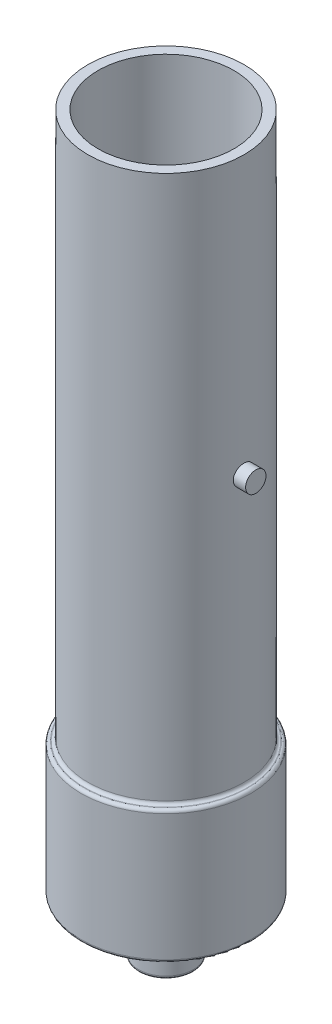
ISO-10303-21;
HEADER;
FILE_DESCRIPTION(('STEP AP214'),'2;1');
FILE_NAME('part.step','',(''),(''),'','','');
FILE_SCHEMA(('AUTOMOTIVE_DESIGN { 1 0 10303 214 1 1 1 1 }'));
ENDSEC;
DATA;
#1=APPLICATION_CONTEXT('core data for automotive mechanical design processes');
#2=APPLICATION_PROTOCOL_DEFINITION('international standard','automotive_design',2000,#1);
#3=PRODUCT_CONTEXT('',#1,'mechanical');
#4=PRODUCT('Part','Part','',(#3));
#5=PRODUCT_RELATED_PRODUCT_CATEGORY('part','',(#4));
#6=PRODUCT_DEFINITION_FORMATION('','',#4);
#7=PRODUCT_DEFINITION_CONTEXT('part definition',#1,'design');
#8=PRODUCT_DEFINITION('design','',#6,#7);
#9=PRODUCT_DEFINITION_SHAPE('','',#8);
#10=(LENGTH_UNIT() NAMED_UNIT(*) SI_UNIT(.MILLI.,.METRE.));
#11=(NAMED_UNIT(*) PLANE_ANGLE_UNIT() SI_UNIT($,.RADIAN.));
#12=(NAMED_UNIT(*) SI_UNIT($,.STERADIAN.) SOLID_ANGLE_UNIT());
#13=UNCERTAINTY_MEASURE_WITH_UNIT(LENGTH_MEASURE(1.E-05),#10,'distance_accuracy_value','');
#14=(GEOMETRIC_REPRESENTATION_CONTEXT(3) GLOBAL_UNCERTAINTY_ASSIGNED_CONTEXT((#13)) GLOBAL_UNIT_ASSIGNED_CONTEXT((#10,
#11,#12)) REPRESENTATION_CONTEXT('',''));
#15=CARTESIAN_POINT('',(0.,0.,0.));
#16=DIRECTION('',(0.,0.,1.));
#17=DIRECTION('',(1.,0.,0.));
#18=AXIS2_PLACEMENT_3D('',#15,#16,#17);
#19=CARTESIAN_POINT('',(0.,87.,0.));
#20=DIRECTION('',(0.,-1.,0.));
#21=DIRECTION('',(0.,0.,-1.));
#22=AXIS2_PLACEMENT_3D('',#19,#20,#21);
#23=CYLINDRICAL_SURFACE('',#22,10.);
#24=CARTESIAN_POINT('',(0.,17.4,0.));
#25=DIRECTION('',(0.,-1.,0.));
#26=DIRECTION('',(0.,0.,-1.));
#27=AXIS2_PLACEMENT_3D('',#24,#25,#26);
#28=CIRCLE('',#27,10.);
#29=CARTESIAN_POINT('',(0.,17.4,-10.));
#30=VERTEX_POINT('',#29);
#31=EDGE_CURVE('E11',#30,#30,#28,.F.);
#32=ORIENTED_EDGE('',*,*,#31,.T.);
#33=EDGE_LOOP('',(#32));
#34=FACE_BOUND('',#33,.T.);
#35=CARTESIAN_POINT('',(9.91448309293026,51.5,-1.305));
#36=CARTESIAN_POINT('',(9.91448418098017,51.4270332152483,-1.30499691434178));
#37=CARTESIAN_POINT('',(9.91529730579845,51.3540214886229,-1.29885962619016));
#38=CARTESIAN_POINT('',(9.91846051986674,51.2100318827835,-1.27447489418102));
#39=CARTESIAN_POINT('',(9.92081219326053,51.1390561786408,-1.25621496814225));
#40=CARTESIAN_POINT('',(9.92678170698423,51.0012440893889,-1.20813410938914));
#41=CARTESIAN_POINT('',(9.93039866484054,50.9344048574338,-1.17832123273123));
#42=CARTESIAN_POINT('',(9.93849014805313,50.8066898021017,-1.10799837386438));
#43=CARTESIAN_POINT('',(9.9429645326472,50.7458130023583,-1.0674901470799));
#44=CARTESIAN_POINT('',(9.95229721603554,50.6313683984253,-0.97666247621837));
#45=CARTESIAN_POINT('',(9.95715747077284,50.5778421534758,-0.926290861734877));
#46=CARTESIAN_POINT('',(9.9666967058992,50.4799773065176,-0.817278680913402));
#47=CARTESIAN_POINT('',(9.97137567707169,50.4356391711413,-0.758637694856652));
#48=CARTESIAN_POINT('',(9.98004527438682,50.3572590999145,-0.63448901325451));
#49=CARTESIAN_POINT('',(9.98403335365794,50.3232549254112,-0.568957284455809));
#50=CARTESIAN_POINT('',(9.99085028381682,50.2667499855573,-0.433052531309081));
#51=CARTESIAN_POINT('',(9.9936791814377,50.2442487564496,-0.362679702266539));
#52=CARTESIAN_POINT('',(9.99784522708334,50.2115130163197,-0.219516157918825));
#53=CARTESIAN_POINT('',(9.99919078993409,50.2012092850941,-0.146741519284059));
#54=CARTESIAN_POINT('',(10.0002673151912,50.1929464182237,-0.000484502484752745));
#55=CARTESIAN_POINT('',(9.99999834649792,50.1949867557944,0.0729978453446168));
#56=CARTESIAN_POINT('',(9.99788290494134,50.2112988089934,0.218113166905785));
#57=CARTESIAN_POINT('',(9.99604603417925,50.2254960751852,0.289754669018367));
#58=CARTESIAN_POINT('',(9.99101193756161,50.2656024988957,0.429629536420904));
#59=CARTESIAN_POINT('',(9.98781468389904,50.2915118958179,0.497862832013257));
#60=CARTESIAN_POINT('',(9.9804025195115,50.3543856714451,0.629213821301065));
#61=CARTESIAN_POINT('',(9.97618466643927,50.3913820884961,0.692316006419299));
#62=CARTESIAN_POINT('',(9.96720282726618,50.4753563894287,0.811444372926343));
#63=CARTESIAN_POINT('',(9.96243881388256,50.5223347720472,0.867470200530354));
#64=CARTESIAN_POINT('',(9.9528555465964,50.6253559892305,0.971293181192356));
#65=CARTESIAN_POINT('',(9.94803614554095,50.6814637328856,1.01902593585157));
#66=CARTESIAN_POINT('',(9.93892021577619,50.8009285073688,1.10440682445899));
#67=CARTESIAN_POINT('',(9.93462368898326,50.8642855647646,1.14205492144678));
#68=CARTESIAN_POINT('',(9.92704006469537,50.9965098620051,1.20620250508217));
#69=CARTESIAN_POINT('',(9.92375346147722,51.0653797792359,1.23269653504608));
#70=CARTESIAN_POINT('',(9.9185712477685,51.2066436704192,1.27372524554413));
#71=CARTESIAN_POINT('',(9.91667556398397,51.2790374584684,1.28826055624324));
#72=CARTESIAN_POINT('',(9.91450333914017,51.4247244766258,1.30487331970326));
#73=CARTESIAN_POINT('',(9.9142150019736,51.4980071876342,1.30704153569554));
#74=CARTESIAN_POINT('',(9.91525889569122,51.6438908275908,1.29909832112043));
#75=CARTESIAN_POINT('',(9.91659108884213,51.7164917723739,1.2889871764722));
#76=CARTESIAN_POINT('',(9.92071516048487,51.8586771340753,1.25684879596861));
#77=CARTESIAN_POINT('',(9.92350162228045,51.9282717142288,1.23486576867507));
#78=CARTESIAN_POINT('',(9.93021586180371,52.0627872807168,1.17965324524407));
#79=CARTESIAN_POINT('',(9.93414368302461,52.1277080888324,1.14642332051874));
#80=CARTESIAN_POINT('',(9.9427262381349,52.2514431184916,1.06943816473376));
#81=CARTESIAN_POINT('',(9.94738501800241,52.3102201199808,1.02562356994277));
#82=CARTESIAN_POINT('',(9.95689197031909,52.4196187236904,0.928796439922654));
#83=CARTESIAN_POINT('',(9.96174015080557,52.4702399793502,0.875783514028994));
#84=CARTESIAN_POINT('',(9.97111600504537,52.5622104343446,0.761667406697446));
#85=CARTESIAN_POINT('',(9.97564149323699,52.6034998875592,0.700515868210137));
#86=CARTESIAN_POINT('',(9.98382912850754,52.6752206960807,0.572092674002406));
#87=CARTESIAN_POINT('',(9.98749129431257,52.7056522869099,0.50482115107275));
#88=CARTESIAN_POINT('',(9.99352998455802,52.7546955196757,0.36626364262335));
#89=CARTESIAN_POINT('',(9.99591021997531,52.7733413070756,0.294989911542307));
#90=CARTESIAN_POINT('',(9.9991323074537,52.798394618939,0.150290142921563));
#91=CARTESIAN_POINT('',(9.99997423544801,52.8048027474728,0.0768642117995393));
#92=CARTESIAN_POINT('',(10.0000244059738,52.8051868432657,-0.0694731056881064));
#93=CARTESIAN_POINT('',(9.99924473505945,52.7992547877692,-0.14238426351655));
#94=CARTESIAN_POINT('',(9.99616340299701,52.7753221885969,-0.286163741689926));
#95=CARTESIAN_POINT('',(9.9938617435951,52.7573216587671,-0.357032064378495));
#96=CARTESIAN_POINT('',(9.98799386414276,52.7097927552354,-0.494699389086431));
#97=CARTESIAN_POINT('',(9.98442817232576,52.6802691964357,-0.561500077308659));
#98=CARTESIAN_POINT('',(9.9764264003035,52.6105418536707,-0.689213612040499));
#99=CARTESIAN_POINT('',(9.9719903060027,52.5703378967406,-0.750126363175478));
#100=CARTESIAN_POINT('',(9.96270305607128,52.4800521790234,-0.864804225818869));
#101=CARTESIAN_POINT('',(9.95784916769583,52.4299020630972,-0.918515303678175));
#102=CARTESIAN_POINT('',(9.94829497455732,52.3212902760302,-1.01679485011713));
#103=CARTESIAN_POINT('',(9.94359470635514,52.2628266437725,-1.06136115541353));
#104=CARTESIAN_POINT('',(9.93485883260752,52.1389633332554,-1.1402484761737));
#105=CARTESIAN_POINT('',(9.93082610720865,52.0735355031878,-1.17452559005079));
#106=CARTESIAN_POINT('',(9.92391564462818,51.9378348657538,-1.23155628624968));
#107=CARTESIAN_POINT('',(9.92103666367204,51.8675673720242,-1.25432228490269));
#108=CARTESIAN_POINT('',(9.91745183183184,51.7474546091809,-1.28229165497502));
#109=CARTESIAN_POINT('',(9.91634417122562,51.6983640104077,-1.29079488130843));
#110=CARTESIAN_POINT('',(9.91485943381736,51.5995225741813,-1.30215008199544));
#111=CARTESIAN_POINT('',(9.91448235075504,51.5497717423895,-1.30500210477392));
#112=CARTESIAN_POINT('',(9.91448309293026,51.5,-1.305));
#113=B_SPLINE_CURVE_WITH_KNOTS('',3,(#35,#36,#37,#38,#39,#40,#41,#42,#43,#44,#45,#46,#47,#48,
#49,#50,#51,#52,#53,#54,#55,#56,#57,#58,#59,#60,#61,#62,#63,#64,#65,#66,#67,#68,#69,#70,#71,#72,
#73,#74,#75,#76,#77,#78,#79,#80,#81,#82,#83,#84,#85,#86,#87,#88,#89,#90,#91,#92,#93,#94,#95,#96,
#97,#98,#99,#100,#101,#102,#103,#104,#105,#106,#107,#108,#109,#110,#111,#112),.UNSPECIFIED.,.T.,
.F.,(4,2,2,2,2,2,2,2,2,2,2,2,2,2,2,2,2,2,2,2,2,2,2,2,2,2,2,2,2,2,2,2,2,2,2,2,2,2,4),(0.,
0.218718510918342,0.4376625772909,0.656454244413546,0.875210023627478,1.09515574483642,
1.31511263359239,1.53586386191316,1.75660618963945,1.97608971678302,2.19556387751207,
2.41370350580401,2.63184759321245,2.85062823548131,3.06941981143372,3.28984102734991,
3.5102630511023,3.73079278261204,3.95131089255834,4.1702084967962,4.38910100420354,
4.60718396342766,4.82527523412072,5.04461928008058,5.26397264413585,5.484692944059,
5.70540845595846,5.9254815509362,6.14554378247608,6.36397166431948,6.58239929556203,
6.80073575427851,7.01907574908423,7.23897180976055,7.45891982913166,7.67979339514733,
7.90042820747751,8.04962067499644,8.1988118640872),.UNSPECIFIED.);
#114=CARTESIAN_POINT('',(9.91448309293026,51.5,-1.305));
#115=VERTEX_POINT('',#114);
#116=EDGE_CURVE('E103',#115,#115,#113,.T.);
#117=ORIENTED_EDGE('',*,*,#116,.T.);
#118=EDGE_LOOP('',(#117));
#119=FACE_BOUND('',#118,.T.);
#120=CARTESIAN_POINT('',(0.,87.,0.));
#121=DIRECTION('',(0.,1.,0.));
#122=DIRECTION('',(0.,0.,1.));
#123=AXIS2_PLACEMENT_3D('',#120,#121,#122);
#124=CIRCLE('',#123,10.);
#125=CARTESIAN_POINT('',(0.,87.,10.));
#126=VERTEX_POINT('',#125);
#127=EDGE_CURVE('E91',#126,#126,#124,.T.);
#128=ORIENTED_EDGE('',*,*,#127,.F.);
#129=EDGE_LOOP('',(#128));
#130=FACE_BOUND('',#129,.T.);
#131=ADVANCED_FACE('F43',(#34,#119,#130),#23,.T.);
#132=CARTESIAN_POINT('',(0.,87.,0.));
#133=DIRECTION('',(0.,-1.,0.));
#134=DIRECTION('',(0.,0.,-1.));
#135=AXIS2_PLACEMENT_3D('',#132,#133,#134);
#136=CYLINDRICAL_SURFACE('',#135,8.7);
#137=CARTESIAN_POINT('',(0.,87.,0.));
#138=DIRECTION('',(0.,1.,0.));
#139=DIRECTION('',(0.,0.,1.));
#140=AXIS2_PLACEMENT_3D('',#137,#138,#139);
#141=CIRCLE('',#140,8.7);
#142=CARTESIAN_POINT('',(0.,87.,8.7));
#143=VERTEX_POINT('',#142);
#144=EDGE_CURVE('E95',#143,#143,#141,.T.);
#145=ORIENTED_EDGE('',*,*,#144,.T.);
#146=EDGE_LOOP('',(#145));
#147=FACE_BOUND('',#146,.T.);
#148=CARTESIAN_POINT('',(0.,3.,0.));
#149=DIRECTION('',(0.,1.,0.));
#150=DIRECTION('',(0.,0.,1.));
#151=AXIS2_PLACEMENT_3D('',#148,#149,#150);
#152=CIRCLE('',#151,8.7);
#153=CARTESIAN_POINT('',(0.,3.,8.7));
#154=VERTEX_POINT('',#153);
#155=EDGE_CURVE('E99',#154,#154,#152,.F.);
#156=ORIENTED_EDGE('',*,*,#155,.T.);
#157=EDGE_LOOP('',(#156));
#158=FACE_BOUND('',#157,.T.);
#159=ADVANCED_FACE('F144',(#147,#158),#136,.F.);
#160=CARTESIAN_POINT('',(0.,87.,0.));
#161=DIRECTION('',(0.,1.,0.));
#162=DIRECTION('',(0.,0.,1.));
#163=AXIS2_PLACEMENT_3D('',#160,#161,#162);
#164=PLANE('',#163);
#165=ORIENTED_EDGE('',*,*,#127,.T.);
#166=EDGE_LOOP('',(#165));
#167=FACE_BOUND('',#166,.T.);
#168=ORIENTED_EDGE('',*,*,#144,.F.);
#169=EDGE_LOOP('',(#168));
#170=FACE_BOUND('',#169,.T.);
#171=ADVANCED_FACE('F142',(#167,#170),#164,.T.);
#172=CARTESIAN_POINT('',(0.,17.,0.));
#173=DIRECTION('',(0.,-1.,0.));
#174=DIRECTION('',(0.,0.,-1.));
#175=AXIS2_PLACEMENT_3D('',#172,#173,#174);
#176=CYLINDRICAL_SURFACE('',#175,10.87);
#177=CARTESIAN_POINT('',(0.,0.400000000000001,0.));
#178=DIRECTION('',(0.,1.,0.));
#179=DIRECTION('',(0.,0.,1.));
#180=AXIS2_PLACEMENT_3D('',#177,#178,#179);
#181=CIRCLE('',#180,10.87);
#182=CARTESIAN_POINT('',(0.,0.400000000000001,10.87));
#183=VERTEX_POINT('',#182);
#184=EDGE_CURVE('E61',#183,#183,#181,.T.);
#185=ORIENTED_EDGE('',*,*,#184,.T.);
#186=EDGE_LOOP('',(#185));
#187=FACE_BOUND('',#186,.T.);
#188=CARTESIAN_POINT('',(0.,16.6,0.));
#189=DIRECTION('',(0.,-1.,0.));
#190=DIRECTION('',(0.,0.,-1.));
#191=AXIS2_PLACEMENT_3D('',#188,#189,#190);
#192=CIRCLE('',#191,10.87);
#193=CARTESIAN_POINT('',(0.,16.6,-10.87));
#194=VERTEX_POINT('',#193);
#195=EDGE_CURVE('E67',#194,#194,#192,.T.);
#196=ORIENTED_EDGE('',*,*,#195,.T.);
#197=EDGE_LOOP('',(#196));
#198=FACE_BOUND('',#197,.T.);
#199=ADVANCED_FACE('F139',(#187,#198),#176,.T.);
#200=CARTESIAN_POINT('',(0.,17.,0.));
#201=DIRECTION('',(0.,-1.,0.));
#202=DIRECTION('',(0.,0.,-1.));
#203=AXIS2_PLACEMENT_3D('',#200,#201,#202);
#204=PLANE('',#203);
#205=CARTESIAN_POINT('',(0.,17.,0.));
#206=DIRECTION('',(0.,-1.,0.));
#207=DIRECTION('',(0.,0.,-1.));
#208=AXIS2_PLACEMENT_3D('',#205,#206,#207);
#209=CIRCLE('',#208,10.47);
#210=CARTESIAN_POINT('',(0.,17.,-10.47));
#211=VERTEX_POINT('',#210);
#212=EDGE_CURVE('E51',#211,#211,#209,.F.);
#213=ORIENTED_EDGE('',*,*,#212,.T.);
#214=EDGE_LOOP('',(#213));
#215=FACE_BOUND('',#214,.T.);
#216=CARTESIAN_POINT('',(0.,17.,0.));
#217=DIRECTION('',(0.,-1.,0.));
#218=DIRECTION('',(0.,0.,-1.));
#219=AXIS2_PLACEMENT_3D('',#216,#217,#218);
#220=CIRCLE('',#219,10.4);
#221=CARTESIAN_POINT('',(0.,17.,-10.4));
#222=VERTEX_POINT('',#221);
#223=EDGE_CURVE('E56',#222,#222,#220,.T.);
#224=ORIENTED_EDGE('',*,*,#223,.T.);
#225=EDGE_LOOP('',(#224));
#226=FACE_BOUND('',#225,.T.);
#227=ADVANCED_FACE('F136',(#215,#226),#204,.F.);
#228=CARTESIAN_POINT('',(0.,0.,0.));
#229=DIRECTION('',(0.,1.,0.));
#230=DIRECTION('',(0.,0.,1.));
#231=AXIS2_PLACEMENT_3D('',#228,#229,#230);
#232=PLANE('',#231);
#233=CARTESIAN_POINT('',(0.,0.,0.));
#234=DIRECTION('',(0.,1.,0.));
#235=DIRECTION('',(0.,0.,1.));
#236=AXIS2_PLACEMENT_3D('',#233,#234,#235);
#237=CIRCLE('',#236,3.92);
#238=CARTESIAN_POINT('',(0.,0.,3.92));
#239=VERTEX_POINT('',#238);
#240=EDGE_CURVE('E71',#239,#239,#237,.T.);
#241=ORIENTED_EDGE('',*,*,#240,.T.);
#242=EDGE_LOOP('',(#241));
#243=FACE_BOUND('',#242,.T.);
#244=CARTESIAN_POINT('',(0.,0.,0.));
#245=DIRECTION('',(0.,1.,0.));
#246=DIRECTION('',(0.,0.,1.));
#247=AXIS2_PLACEMENT_3D('',#244,#245,#246);
#248=CIRCLE('',#247,10.47);
#249=CARTESIAN_POINT('',(0.,0.,10.47));
#250=VERTEX_POINT('',#249);
#251=EDGE_CURVE('E75',#250,#250,#248,.F.);
#252=ORIENTED_EDGE('',*,*,#251,.T.);
#253=EDGE_LOOP('',(#252));
#254=FACE_BOUND('',#253,.T.);
#255=ADVANCED_FACE('F134',(#243,#254),#232,.F.);
#256=CARTESIAN_POINT('',(0.,-7.,0.));
#257=DIRECTION('',(0.,1.,0.));
#258=DIRECTION('',(0.,0.,1.));
#259=AXIS2_PLACEMENT_3D('',#256,#257,#258);
#260=CYLINDRICAL_SURFACE('',#259,3.52);
#261=CARTESIAN_POINT('',(0.,-6.6,0.));
#262=DIRECTION('',(0.,-1.,0.));
#263=DIRECTION('',(0.,0.,-1.));
#264=AXIS2_PLACEMENT_3D('',#261,#262,#263);
#265=CIRCLE('',#264,3.52);
#266=CARTESIAN_POINT('',(0.,-6.6,-3.52));
#267=VERTEX_POINT('',#266);
#268=EDGE_CURVE('E79',#267,#267,#265,.F.);
#269=ORIENTED_EDGE('',*,*,#268,.T.);
#270=EDGE_LOOP('',(#269));
#271=FACE_BOUND('',#270,.T.);
#272=CARTESIAN_POINT('',(0.,-0.4,0.));
#273=DIRECTION('',(0.,1.,0.));
#274=DIRECTION('',(0.,0.,1.));
#275=AXIS2_PLACEMENT_3D('',#272,#273,#274);
#276=CIRCLE('',#275,3.52);
#277=CARTESIAN_POINT('',(0.,-0.4,3.52));
#278=VERTEX_POINT('',#277);
#279=EDGE_CURVE('E83',#278,#278,#276,.F.);
#280=ORIENTED_EDGE('',*,*,#279,.T.);
#281=EDGE_LOOP('',(#280));
#282=FACE_BOUND('',#281,.T.);
#283=ADVANCED_FACE('F130',(#271,#282),#260,.T.);
#284=CARTESIAN_POINT('',(0.,-7.,0.));
#285=DIRECTION('',(0.,-1.,0.));
#286=DIRECTION('',(0.,0.,-1.));
#287=AXIS2_PLACEMENT_3D('',#284,#285,#286);
#288=PLANE('',#287);
#289=CARTESIAN_POINT('',(0.,-7.,0.));
#290=DIRECTION('',(0.,-1.,0.));
#291=DIRECTION('',(0.,0.,-1.));
#292=AXIS2_PLACEMENT_3D('',#289,#290,#291);
#293=CIRCLE('',#292,3.12);
#294=CARTESIAN_POINT('',(0.,-7.,-3.12));
#295=VERTEX_POINT('',#294);
#296=EDGE_CURVE('E87',#295,#295,#293,.T.);
#297=ORIENTED_EDGE('',*,*,#296,.T.);
#298=EDGE_LOOP('',(#297));
#299=FACE_BOUND('',#298,.T.);
#300=ADVANCED_FACE('F126',(#299),#288,.T.);
#301=CARTESIAN_POINT('',(0.,3.,0.));
#302=DIRECTION('',(0.,1.,0.));
#303=DIRECTION('',(0.,0.,1.));
#304=AXIS2_PLACEMENT_3D('',#301,#302,#303);
#305=PLANE('',#304);
#306=ORIENTED_EDGE('',*,*,#155,.F.);
#307=EDGE_LOOP('',(#306));
#308=FACE_BOUND('',#307,.T.);
#309=ADVANCED_FACE('F122',(#308),#305,.T.);
#310=CARTESIAN_POINT('',(-10.871,51.5,0.));
#311=DIRECTION('',(1.,0.,0.));
#312=DIRECTION('',(0.,0.,-1.));
#313=AXIS2_PLACEMENT_3D('',#310,#311,#312);
#314=CYLINDRICAL_SURFACE('',#313,1.305);
#315=CARTESIAN_POINT('',(11.5,51.5,0.));
#316=DIRECTION('',(1.,0.,0.));
#317=DIRECTION('',(0.,0.,-1.));
#318=AXIS2_PLACEMENT_3D('',#315,#316,#317);
#319=CIRCLE('',#318,1.305);
#320=CARTESIAN_POINT('',(11.5,51.5,-1.305));
#321=VERTEX_POINT('',#320);
#322=EDGE_CURVE('E112',#321,#321,#319,.T.);
#323=ORIENTED_EDGE('',*,*,#322,.F.);
#324=EDGE_LOOP('',(#323));
#325=FACE_BOUND('',#324,.T.);
#326=ORIENTED_EDGE('',*,*,#116,.F.);
#327=EDGE_LOOP('',(#326));
#328=FACE_BOUND('',#327,.T.);
#329=ADVANCED_FACE('F116',(#325,#328),#314,.T.);
#330=CARTESIAN_POINT('',(11.5,51.5,0.));
#331=DIRECTION('',(1.,0.,0.));
#332=DIRECTION('',(0.,0.,-1.));
#333=AXIS2_PLACEMENT_3D('',#330,#331,#332);
#334=PLANE('',#333);
#335=ORIENTED_EDGE('',*,*,#322,.T.);
#336=EDGE_LOOP('',(#335));
#337=FACE_BOUND('',#336,.T.);
#338=ADVANCED_FACE('F121',(#337),#334,.T.);
#339=CARTESIAN_POINT('',(0.,-6.6,0.));
#340=DIRECTION('',(0.,-1.,0.));
#341=DIRECTION('',(0.,0.,-1.));
#342=AXIS2_PLACEMENT_3D('',#339,#340,#341);
#343=TOROIDAL_SURFACE('',#342,3.12,0.4);
#344=ORIENTED_EDGE('',*,*,#268,.F.);
#345=EDGE_LOOP('',(#344));
#346=FACE_BOUND('',#345,.T.);
#347=ORIENTED_EDGE('',*,*,#296,.F.);
#348=EDGE_LOOP('',(#347));
#349=FACE_BOUND('',#348,.T.);
#350=ADVANCED_FACE('F211',(#346,#349),#343,.T.);
#351=CARTESIAN_POINT('',(0.,-0.4,0.));
#352=DIRECTION('',(0.,1.,0.));
#353=DIRECTION('',(0.,0.,1.));
#354=AXIS2_PLACEMENT_3D('',#351,#352,#353);
#355=TOROIDAL_SURFACE('',#354,3.92,0.4);
#356=ORIENTED_EDGE('',*,*,#240,.F.);
#357=EDGE_LOOP('',(#356));
#358=FACE_BOUND('',#357,.T.);
#359=ORIENTED_EDGE('',*,*,#279,.F.);
#360=EDGE_LOOP('',(#359));
#361=FACE_BOUND('',#360,.T.);
#362=ADVANCED_FACE('F216',(#358,#361),#355,.F.);
#363=CARTESIAN_POINT('',(0.,0.400000000000001,0.));
#364=DIRECTION('',(0.,1.,0.));
#365=DIRECTION('',(0.,0.,1.));
#366=AXIS2_PLACEMENT_3D('',#363,#364,#365);
#367=TOROIDAL_SURFACE('',#366,10.47,0.4);
#368=ORIENTED_EDGE('',*,*,#184,.F.);
#369=EDGE_LOOP('',(#368));
#370=FACE_BOUND('',#369,.T.);
#371=ORIENTED_EDGE('',*,*,#251,.F.);
#372=EDGE_LOOP('',(#371));
#373=FACE_BOUND('',#372,.T.);
#374=ADVANCED_FACE('F228',(#370,#373),#367,.T.);
#375=CARTESIAN_POINT('',(0.,16.6,0.));
#376=DIRECTION('',(0.,-1.,0.));
#377=DIRECTION('',(0.,0.,-1.));
#378=AXIS2_PLACEMENT_3D('',#375,#376,#377);
#379=TOROIDAL_SURFACE('',#378,10.47,0.4);
#380=ORIENTED_EDGE('',*,*,#212,.F.);
#381=EDGE_LOOP('',(#380));
#382=FACE_BOUND('',#381,.T.);
#383=ORIENTED_EDGE('',*,*,#195,.F.);
#384=EDGE_LOOP('',(#383));
#385=FACE_BOUND('',#384,.T.);
#386=ADVANCED_FACE('F239',(#382,#385),#379,.T.);
#387=CARTESIAN_POINT('',(0.,17.4,0.));
#388=DIRECTION('',(0.,-1.,0.));
#389=DIRECTION('',(0.,0.,-1.));
#390=AXIS2_PLACEMENT_3D('',#387,#388,#389);
#391=TOROIDAL_SURFACE('',#390,10.4,0.4);
#392=ORIENTED_EDGE('',*,*,#31,.F.);
#393=EDGE_LOOP('',(#392));
#394=FACE_BOUND('',#393,.T.);
#395=ORIENTED_EDGE('',*,*,#223,.F.);
#396=EDGE_LOOP('',(#395));
#397=FACE_BOUND('',#396,.T.);
#398=ADVANCED_FACE('F45',(#394,#397),#391,.F.);
#399=CLOSED_SHELL('',(#131,#159,#171,#199,#227,#255,#283,#300,#309,#329,#338,#350,#362,#374,
#386,#398));
#400=MANIFOLD_SOLID_BREP('B2',#399);
#401=ADVANCED_BREP_SHAPE_REPRESENTATION('',(#18,#400),#14);
#402=SHAPE_DEFINITION_REPRESENTATION(#9,#401);
ENDSEC;
END-ISO-10303-21;
